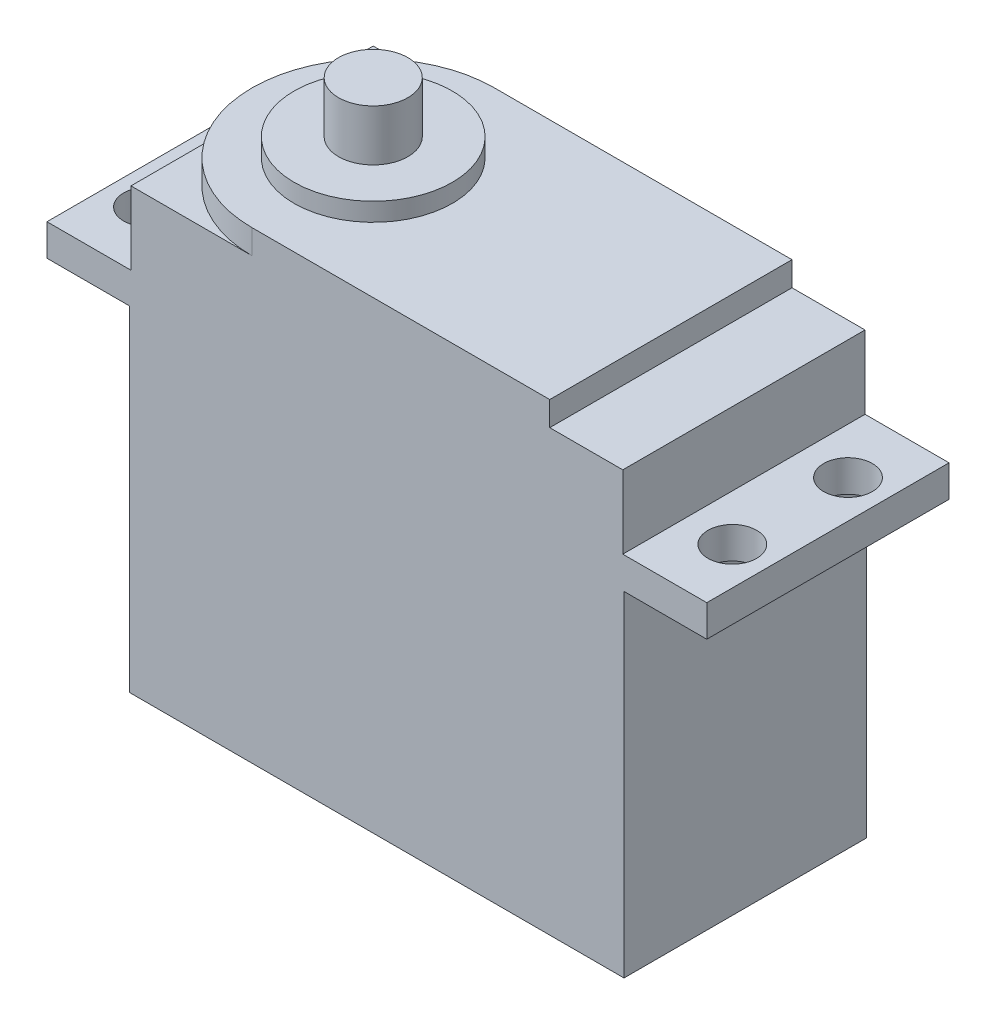
ISO-10303-21;
HEADER;
FILE_DESCRIPTION(('STEP AP214'),'2;1');
FILE_NAME('part.step','',(''),(''),'','','');
FILE_SCHEMA(('AUTOMOTIVE_DESIGN { 1 0 10303 214 1 1 1 1 }'));
ENDSEC;
DATA;
#1=APPLICATION_CONTEXT('core data for automotive mechanical design processes');
#2=APPLICATION_PROTOCOL_DEFINITION('international standard','automotive_design',2000,#1);
#3=PRODUCT_CONTEXT('',#1,'mechanical');
#4=PRODUCT('Part','Part','',(#3));
#5=PRODUCT_RELATED_PRODUCT_CATEGORY('part','',(#4));
#6=PRODUCT_DEFINITION_FORMATION('','',#4);
#7=PRODUCT_DEFINITION_CONTEXT('part definition',#1,'design');
#8=PRODUCT_DEFINITION('design','',#6,#7);
#9=PRODUCT_DEFINITION_SHAPE('','',#8);
#10=(LENGTH_UNIT() NAMED_UNIT(*) SI_UNIT(.MILLI.,.METRE.));
#11=(NAMED_UNIT(*) PLANE_ANGLE_UNIT() SI_UNIT($,.RADIAN.));
#12=(NAMED_UNIT(*) SI_UNIT($,.STERADIAN.) SOLID_ANGLE_UNIT());
#13=UNCERTAINTY_MEASURE_WITH_UNIT(LENGTH_MEASURE(1.E-05),#10,'distance_accuracy_value','');
#14=(GEOMETRIC_REPRESENTATION_CONTEXT(3) GLOBAL_UNCERTAINTY_ASSIGNED_CONTEXT((#13)) GLOBAL_UNIT_ASSIGNED_CONTEXT((#10,
#11,#12)) REPRESENTATION_CONTEXT('',''));
#15=CARTESIAN_POINT('',(0.,0.,0.));
#16=DIRECTION('',(0.,0.,1.));
#17=DIRECTION('',(1.,0.,0.));
#18=AXIS2_PLACEMENT_3D('',#15,#16,#17);
#19=CARTESIAN_POINT('',(0.,36.1,0.));
#20=DIRECTION('',(0.,1.,0.));
#21=DIRECTION('',(0.,0.,1.));
#22=AXIS2_PLACEMENT_3D('',#19,#20,#21);
#23=PLANE('',#22);
#24=DIRECTION('',(-1.,0.,0.));
#25=VECTOR('',#24,1.);
#26=CARTESIAN_POINT('',(-20.2,36.1,-9.95));
#27=LINE('',#26,#25);
#28=CARTESIAN_POINT('',(20.2,36.1,-9.95));
#29=VERTEX_POINT('',#28);
#30=CARTESIAN_POINT('',(14.2,36.1,-9.95));
#31=VERTEX_POINT('',#30);
#32=EDGE_CURVE('E189',#29,#31,#27,.T.);
#33=ORIENTED_EDGE('',*,*,#32,.T.);
#34=DIRECTION('',(0.,0.,1.));
#35=VECTOR('',#34,1.);
#36=CARTESIAN_POINT('',(14.2,36.1,0.));
#37=LINE('',#36,#35);
#38=CARTESIAN_POINT('',(14.2,36.1,9.95));
#39=VERTEX_POINT('',#38);
#40=EDGE_CURVE('E53',#31,#39,#37,.T.);
#41=ORIENTED_EDGE('',*,*,#40,.T.);
#42=DIRECTION('',(1.,0.,0.));
#43=VECTOR('',#42,1.);
#44=CARTESIAN_POINT('',(-20.2,36.1,9.95));
#45=LINE('',#44,#43);
#46=CARTESIAN_POINT('',(20.2,36.1,9.95));
#47=VERTEX_POINT('',#46);
#48=EDGE_CURVE('E195',#39,#47,#45,.T.);
#49=ORIENTED_EDGE('',*,*,#48,.T.);
#50=DIRECTION('',(0.,0.,-1.));
#51=VECTOR('',#50,1.);
#52=CARTESIAN_POINT('',(20.2,36.1,-9.95));
#53=LINE('',#52,#51);
#54=EDGE_CURVE('E186',#47,#29,#53,.T.);
#55=ORIENTED_EDGE('',*,*,#54,.T.);
#56=EDGE_LOOP('',(#33,#41,#49,#55));
#57=FACE_BOUND('',#56,.T.);
#58=ADVANCED_FACE('F36',(#57),#23,.T.);
#59=CARTESIAN_POINT('',(-10.25,36.1,0.));
#60=DIRECTION('',(0.,1.,0.));
#61=DIRECTION('',(0.,0.,1.));
#62=AXIS2_PLACEMENT_3D('',#59,#60,#61);
#63=CIRCLE('',#62,9.95);
#64=CARTESIAN_POINT('',(-10.25,36.1,-9.95));
#65=VERTEX_POINT('',#64);
#66=CARTESIAN_POINT('',(-20.2,36.1,0.));
#67=VERTEX_POINT('',#66);
#68=EDGE_CURVE('E46',#65,#67,#63,.T.);
#69=ORIENTED_EDGE('',*,*,#68,.F.);
#70=CARTESIAN_POINT('',(-20.2,36.1,-9.95));
#71=VERTEX_POINT('',#70);
#72=EDGE_CURVE('E176',#65,#71,#27,.T.);
#73=ORIENTED_EDGE('',*,*,#72,.T.);
#74=DIRECTION('',(0.,0.,1.));
#75=VECTOR('',#74,1.);
#76=CARTESIAN_POINT('',(-20.2,36.1,-9.95));
#77=LINE('',#76,#75);
#78=EDGE_CURVE('E192',#71,#67,#77,.T.);
#79=ORIENTED_EDGE('',*,*,#78,.T.);
#80=EDGE_LOOP('',(#69,#73,#79));
#81=FACE_BOUND('',#80,.T.);
#82=ADVANCED_FACE('F327',(#81),#23,.T.);
#83=CARTESIAN_POINT('',(0.,30.1,0.));
#84=DIRECTION('',(0.,1.,0.));
#85=DIRECTION('',(0.,0.,1.));
#86=AXIS2_PLACEMENT_3D('',#83,#84,#85);
#87=PLANE('',#86);
#88=DIRECTION('',(0.,0.,-1.));
#89=VECTOR('',#88,1.);
#90=CARTESIAN_POINT('',(20.2,30.1,-9.95));
#91=LINE('',#90,#89);
#92=CARTESIAN_POINT('',(20.2,30.1,9.95));
#93=VERTEX_POINT('',#92);
#94=CARTESIAN_POINT('',(20.2,30.1,-9.95));
#95=VERTEX_POINT('',#94);
#96=EDGE_CURVE('E177',#93,#95,#91,.T.);
#97=ORIENTED_EDGE('',*,*,#96,.F.);
#98=DIRECTION('',(1.,0.,0.));
#99=VECTOR('',#98,1.);
#100=CARTESIAN_POINT('',(-27.1,30.1,9.95));
#101=LINE('',#100,#99);
#102=CARTESIAN_POINT('',(27.1,30.1,9.95));
#103=VERTEX_POINT('',#102);
#104=EDGE_CURVE('E246',#93,#103,#101,.T.);
#105=ORIENTED_EDGE('',*,*,#104,.T.);
#106=DIRECTION('',(0.,0.,-1.));
#107=VECTOR('',#106,1.);
#108=CARTESIAN_POINT('',(27.1,30.1,-9.95));
#109=LINE('',#108,#107);
#110=CARTESIAN_POINT('',(27.1,30.1,-9.95));
#111=VERTEX_POINT('',#110);
#112=EDGE_CURVE('E237',#103,#111,#109,.T.);
#113=ORIENTED_EDGE('',*,*,#112,.T.);
#114=DIRECTION('',(-1.,0.,0.));
#115=VECTOR('',#114,1.);
#116=CARTESIAN_POINT('',(-27.1,30.1,-9.95));
#117=LINE('',#116,#115);
#118=EDGE_CURVE('E242',#111,#95,#117,.T.);
#119=ORIENTED_EDGE('',*,*,#118,.T.);
#120=EDGE_LOOP('',(#97,#105,#113,#119));
#121=FACE_BOUND('',#120,.T.);
#122=CARTESIAN_POINT('',(24.,30.1,-4.75));
#123=DIRECTION('',(0.,1.,0.));
#124=DIRECTION('',(0.,0.,-1.));
#125=AXIS2_PLACEMENT_3D('',#122,#123,#124);
#126=CIRCLE('',#125,2.);
#127=CARTESIAN_POINT('',(24.,30.1,-6.75000000000001));
#128=VERTEX_POINT('',#127);
#129=EDGE_CURVE('E213',#128,#128,#126,.T.);
#130=ORIENTED_EDGE('',*,*,#129,.F.);
#131=EDGE_LOOP('',(#130));
#132=FACE_BOUND('',#131,.T.);
#133=CARTESIAN_POINT('',(24.,30.1,4.74999999999999));
#134=DIRECTION('',(0.,1.,0.));
#135=DIRECTION('',(0.,0.,-1.));
#136=AXIS2_PLACEMENT_3D('',#133,#134,#135);
#137=CIRCLE('',#136,2.);
#138=CARTESIAN_POINT('',(24.,30.1,2.74999999999999));
#139=VERTEX_POINT('',#138);
#140=EDGE_CURVE('E219',#139,#139,#137,.T.);
#141=ORIENTED_EDGE('',*,*,#140,.F.);
#142=EDGE_LOOP('',(#141));
#143=FACE_BOUND('',#142,.T.);
#144=ADVANCED_FACE('F350',(#121,#132,#143),#87,.T.);
#145=CARTESIAN_POINT('',(20.3,27.5,-9.95));
#146=DIRECTION('',(-1.,0.,0.));
#147=DIRECTION('',(0.,0.,1.));
#148=AXIS2_PLACEMENT_3D('',#145,#146,#147);
#149=PLANE('',#148);
#150=DIRECTION('',(0.,0.,-1.));
#151=VECTOR('',#150,1.);
#152=CARTESIAN_POINT('',(20.3,0.,-9.95));
#153=LINE('',#152,#151);
#154=CARTESIAN_POINT('',(20.3,0.,9.95));
#155=VERTEX_POINT('',#154);
#156=CARTESIAN_POINT('',(20.3,0.,-9.95));
#157=VERTEX_POINT('',#156);
#158=EDGE_CURVE('E272',#155,#157,#153,.T.);
#159=ORIENTED_EDGE('',*,*,#158,.T.);
#160=DIRECTION('',(0.,-1.,0.));
#161=VECTOR('',#160,1.);
#162=CARTESIAN_POINT('',(20.3,27.5,-9.95));
#163=LINE('',#162,#161);
#164=CARTESIAN_POINT('',(20.3,27.5,-9.95));
#165=VERTEX_POINT('',#164);
#166=EDGE_CURVE('E40',#165,#157,#163,.T.);
#167=ORIENTED_EDGE('',*,*,#166,.F.);
#168=DIRECTION('',(0.,0.,-1.));
#169=VECTOR('',#168,1.);
#170=CARTESIAN_POINT('',(20.3,27.5,-9.95));
#171=LINE('',#170,#169);
#172=CARTESIAN_POINT('',(20.3,27.5,9.95));
#173=VERTEX_POINT('',#172);
#174=EDGE_CURVE('E273',#173,#165,#171,.T.);
#175=ORIENTED_EDGE('',*,*,#174,.F.);
#176=DIRECTION('',(0.,-1.,0.));
#177=VECTOR('',#176,1.);
#178=CARTESIAN_POINT('',(20.3,27.5,9.95));
#179=LINE('',#178,#177);
#180=EDGE_CURVE('E280',#173,#155,#179,.T.);
#181=ORIENTED_EDGE('',*,*,#180,.T.);
#182=EDGE_LOOP('',(#159,#167,#175,#181));
#183=FACE_BOUND('',#182,.T.);
#184=ADVANCED_FACE('F38',(#183),#149,.F.);
#185=CARTESIAN_POINT('',(-20.3,27.5,-9.95));
#186=DIRECTION('',(0.,0.,1.));
#187=DIRECTION('',(1.,0.,0.));
#188=AXIS2_PLACEMENT_3D('',#185,#186,#187);
#189=PLANE('',#188);
#190=DIRECTION('',(-1.,0.,0.));
#191=VECTOR('',#190,1.);
#192=CARTESIAN_POINT('',(-20.3,0.,-9.95));
#193=LINE('',#192,#191);
#194=CARTESIAN_POINT('',(-20.3,0.,-9.95));
#195=VERTEX_POINT('',#194);
#196=EDGE_CURVE('E283',#157,#195,#193,.T.);
#197=ORIENTED_EDGE('',*,*,#196,.T.);
#198=DIRECTION('',(0.,-1.,0.));
#199=VECTOR('',#198,1.);
#200=CARTESIAN_POINT('',(-20.3,27.5,-9.95));
#201=LINE('',#200,#199);
#202=CARTESIAN_POINT('',(-20.3,27.5,-9.95));
#203=VERTEX_POINT('',#202);
#204=EDGE_CURVE('E292',#203,#195,#201,.T.);
#205=ORIENTED_EDGE('',*,*,#204,.F.);
#206=DIRECTION('',(-1.,0.,0.));
#207=VECTOR('',#206,1.);
#208=CARTESIAN_POINT('',(-27.1,27.5,-9.95));
#209=LINE('',#208,#207);
#210=CARTESIAN_POINT('',(-27.1,27.5,-9.95));
#211=VERTEX_POINT('',#210);
#212=EDGE_CURVE('E252',#203,#211,#209,.T.);
#213=ORIENTED_EDGE('',*,*,#212,.T.);
#214=DIRECTION('',(0.,-1.,0.));
#215=VECTOR('',#214,1.);
#216=CARTESIAN_POINT('',(-27.1,30.1,-9.95));
#217=LINE('',#216,#215);
#218=CARTESIAN_POINT('',(-27.1,30.1,-9.95));
#219=VERTEX_POINT('',#218);
#220=EDGE_CURVE('E266',#219,#211,#217,.T.);
#221=ORIENTED_EDGE('',*,*,#220,.F.);
#222=CARTESIAN_POINT('',(-20.2,30.1,-9.95));
#223=VERTEX_POINT('',#222);
#224=EDGE_CURVE('E240',#223,#219,#117,.T.);
#225=ORIENTED_EDGE('',*,*,#224,.F.);
#226=DIRECTION('',(0.,-1.,0.));
#227=VECTOR('',#226,1.);
#228=CARTESIAN_POINT('',(-20.2,36.1,-9.95));
#229=LINE('',#228,#227);
#230=EDGE_CURVE('E206',#71,#223,#229,.T.);
#231=ORIENTED_EDGE('',*,*,#230,.F.);
#232=ORIENTED_EDGE('',*,*,#72,.F.);
#233=DIRECTION('',(0.,-1.,0.));
#234=VECTOR('',#233,1.);
#235=CARTESIAN_POINT('',(-10.25,38.1,-9.95));
#236=LINE('',#235,#234);
#237=CARTESIAN_POINT('',(-10.25,38.1,-9.95));
#238=VERTEX_POINT('',#237);
#239=EDGE_CURVE('E157',#238,#65,#236,.T.);
#240=ORIENTED_EDGE('',*,*,#239,.F.);
#241=DIRECTION('',(-1.,0.,0.));
#242=VECTOR('',#241,1.);
#243=CARTESIAN_POINT('',(0.,38.1,-9.95));
#244=LINE('',#243,#242);
#245=CARTESIAN_POINT('',(14.2,38.1,-9.95));
#246=VERTEX_POINT('',#245);
#247=EDGE_CURVE('E163',#246,#238,#244,.T.);
#248=ORIENTED_EDGE('',*,*,#247,.F.);
#249=DIRECTION('',(0.,-1.,0.));
#250=VECTOR('',#249,1.);
#251=CARTESIAN_POINT('',(14.2,38.1,-9.95));
#252=LINE('',#251,#250);
#253=EDGE_CURVE('E336',#246,#31,#252,.T.);
#254=ORIENTED_EDGE('',*,*,#253,.T.);
#255=ORIENTED_EDGE('',*,*,#32,.F.);
#256=DIRECTION('',(0.,-1.,0.));
#257=VECTOR('',#256,1.);
#258=CARTESIAN_POINT('',(20.2,36.1,-9.95));
#259=LINE('',#258,#257);
#260=EDGE_CURVE('E209',#29,#95,#259,.T.);
#261=ORIENTED_EDGE('',*,*,#260,.T.);
#262=ORIENTED_EDGE('',*,*,#118,.F.);
#263=DIRECTION('',(0.,-1.,0.));
#264=VECTOR('',#263,1.);
#265=CARTESIAN_POINT('',(27.1,30.1,-9.95));
#266=LINE('',#265,#264);
#267=CARTESIAN_POINT('',(27.1,27.5,-9.95));
#268=VERTEX_POINT('',#267);
#269=EDGE_CURVE('E269',#111,#268,#266,.T.);
#270=ORIENTED_EDGE('',*,*,#269,.T.);
#271=EDGE_CURVE('E253',#268,#165,#209,.T.);
#272=ORIENTED_EDGE('',*,*,#271,.T.);
#273=ORIENTED_EDGE('',*,*,#166,.T.);
#274=EDGE_LOOP('',(#197,#205,#213,#221,#225,#231,#232,#240,#248,#254,#255,#261,#262,#270,#272,#273));
#275=FACE_BOUND('',#274,.T.);
#276=ADVANCED_FACE('F174',(#275),#189,.F.);
#277=CARTESIAN_POINT('',(-20.3,27.5,-9.95));
#278=DIRECTION('',(1.,0.,0.));
#279=DIRECTION('',(0.,0.,-1.));
#280=AXIS2_PLACEMENT_3D('',#277,#278,#279);
#281=PLANE('',#280);
#282=DIRECTION('',(0.,0.,1.));
#283=VECTOR('',#282,1.);
#284=CARTESIAN_POINT('',(-20.3,0.,-9.95));
#285=LINE('',#284,#283);
#286=CARTESIAN_POINT('',(-20.3,0.,9.95));
#287=VERTEX_POINT('',#286);
#288=EDGE_CURVE('E285',#195,#287,#285,.T.);
#289=ORIENTED_EDGE('',*,*,#288,.T.);
#290=DIRECTION('',(0.,-1.,0.));
#291=VECTOR('',#290,1.);
#292=CARTESIAN_POINT('',(-20.3,27.5,9.95));
#293=LINE('',#292,#291);
#294=CARTESIAN_POINT('',(-20.3,27.5,9.95));
#295=VERTEX_POINT('',#294);
#296=EDGE_CURVE('E290',#295,#287,#293,.T.);
#297=ORIENTED_EDGE('',*,*,#296,.F.);
#298=DIRECTION('',(0.,0.,1.));
#299=VECTOR('',#298,1.);
#300=CARTESIAN_POINT('',(-20.3,27.5,-9.95));
#301=LINE('',#300,#299);
#302=EDGE_CURVE('E276',#203,#295,#301,.T.);
#303=ORIENTED_EDGE('',*,*,#302,.F.);
#304=ORIENTED_EDGE('',*,*,#204,.T.);
#305=EDGE_LOOP('',(#289,#297,#303,#304));
#306=FACE_BOUND('',#305,.T.);
#307=ADVANCED_FACE('F304',(#306),#281,.F.);
#308=CARTESIAN_POINT('',(-20.3,27.5,9.95));
#309=DIRECTION('',(0.,0.,-1.));
#310=DIRECTION('',(-1.,0.,0.));
#311=AXIS2_PLACEMENT_3D('',#308,#309,#310);
#312=PLANE('',#311);
#313=DIRECTION('',(1.,0.,0.));
#314=VECTOR('',#313,1.);
#315=CARTESIAN_POINT('',(-20.3,0.,9.95));
#316=LINE('',#315,#314);
#317=EDGE_CURVE('E277',#287,#155,#316,.T.);
#318=ORIENTED_EDGE('',*,*,#317,.T.);
#319=ORIENTED_EDGE('',*,*,#180,.F.);
#320=DIRECTION('',(1.,0.,0.));
#321=VECTOR('',#320,1.);
#322=CARTESIAN_POINT('',(-27.1,27.5,9.95));
#323=LINE('',#322,#321);
#324=CARTESIAN_POINT('',(27.1,27.5,9.95));
#325=VERTEX_POINT('',#324);
#326=EDGE_CURVE('E258',#173,#325,#323,.T.);
#327=ORIENTED_EDGE('',*,*,#326,.T.);
#328=DIRECTION('',(0.,-1.,0.));
#329=VECTOR('',#328,1.);
#330=CARTESIAN_POINT('',(27.1,30.1,9.95));
#331=LINE('',#330,#329);
#332=EDGE_CURVE('E249',#103,#325,#331,.T.);
#333=ORIENTED_EDGE('',*,*,#332,.F.);
#334=ORIENTED_EDGE('',*,*,#104,.F.);
#335=DIRECTION('',(0.,-1.,0.));
#336=VECTOR('',#335,1.);
#337=CARTESIAN_POINT('',(20.2,36.1,9.95));
#338=LINE('',#337,#336);
#339=EDGE_CURVE('E197',#47,#93,#338,.T.);
#340=ORIENTED_EDGE('',*,*,#339,.F.);
#341=ORIENTED_EDGE('',*,*,#48,.F.);
#342=DIRECTION('',(0.,-1.,0.));
#343=VECTOR('',#342,1.);
#344=CARTESIAN_POINT('',(14.2,38.1,9.95));
#345=LINE('',#344,#343);
#346=CARTESIAN_POINT('',(14.2,38.1,9.95));
#347=VERTEX_POINT('',#346);
#348=EDGE_CURVE('E182',#347,#39,#345,.T.);
#349=ORIENTED_EDGE('',*,*,#348,.F.);
#350=DIRECTION('',(1.,0.,0.));
#351=VECTOR('',#350,1.);
#352=CARTESIAN_POINT('',(0.,38.1,9.95));
#353=LINE('',#352,#351);
#354=CARTESIAN_POINT('',(-10.25,38.1,9.95));
#355=VERTEX_POINT('',#354);
#356=EDGE_CURVE('E162',#355,#347,#353,.T.);
#357=ORIENTED_EDGE('',*,*,#356,.F.);
#358=DIRECTION('',(0.,-1.,0.));
#359=VECTOR('',#358,1.);
#360=CARTESIAN_POINT('',(-10.25,38.1,9.95));
#361=LINE('',#360,#359);
#362=CARTESIAN_POINT('',(-10.25,36.1,9.95));
#363=VERTEX_POINT('',#362);
#364=EDGE_CURVE('E159',#355,#363,#361,.T.);
#365=ORIENTED_EDGE('',*,*,#364,.T.);
#366=CARTESIAN_POINT('',(-20.2,36.1,9.95));
#367=VERTEX_POINT('',#366);
#368=EDGE_CURVE('E196',#367,#363,#45,.T.);
#369=ORIENTED_EDGE('',*,*,#368,.F.);
#370=DIRECTION('',(0.,-1.,0.));
#371=VECTOR('',#370,1.);
#372=CARTESIAN_POINT('',(-20.2,36.1,9.95));
#373=LINE('',#372,#371);
#374=CARTESIAN_POINT('',(-20.2,30.1,9.95));
#375=VERTEX_POINT('',#374);
#376=EDGE_CURVE('E203',#367,#375,#373,.T.);
#377=ORIENTED_EDGE('',*,*,#376,.T.);
#378=CARTESIAN_POINT('',(-27.1,30.1,9.95));
#379=VERTEX_POINT('',#378);
#380=EDGE_CURVE('E247',#379,#375,#101,.T.);
#381=ORIENTED_EDGE('',*,*,#380,.F.);
#382=DIRECTION('',(0.,-1.,0.));
#383=VECTOR('',#382,1.);
#384=CARTESIAN_POINT('',(-27.1,30.1,9.95));
#385=LINE('',#384,#383);
#386=CARTESIAN_POINT('',(-27.1,27.5,9.95));
#387=VERTEX_POINT('',#386);
#388=EDGE_CURVE('E263',#379,#387,#385,.T.);
#389=ORIENTED_EDGE('',*,*,#388,.T.);
#390=EDGE_CURVE('E241',#387,#295,#323,.T.);
#391=ORIENTED_EDGE('',*,*,#390,.T.);
#392=ORIENTED_EDGE('',*,*,#296,.T.);
#393=EDGE_LOOP('',(#318,#319,#327,#333,#334,#340,#341,#349,#357,#365,#369,#377,#381,#389,#391,#392));
#394=FACE_BOUND('',#393,.T.);
#395=ADVANCED_FACE('F306',(#394),#312,.F.);
#396=CARTESIAN_POINT('',(0.,0.,0.));
#397=DIRECTION('',(0.,1.,0.));
#398=DIRECTION('',(0.,0.,1.));
#399=AXIS2_PLACEMENT_3D('',#396,#397,#398);
#400=PLANE('',#399);
#401=ORIENTED_EDGE('',*,*,#158,.F.);
#402=ORIENTED_EDGE('',*,*,#317,.F.);
#403=ORIENTED_EDGE('',*,*,#288,.F.);
#404=ORIENTED_EDGE('',*,*,#196,.F.);
#405=EDGE_LOOP('',(#401,#402,#403,#404));
#406=FACE_BOUND('',#405,.T.);
#407=ADVANCED_FACE('F303',(#406),#400,.F.);
#408=CARTESIAN_POINT('',(0.,27.5,0.));
#409=DIRECTION('',(0.,1.,0.));
#410=DIRECTION('',(0.,0.,1.));
#411=AXIS2_PLACEMENT_3D('',#408,#409,#410);
#412=PLANE('',#411);
#413=CARTESIAN_POINT('',(24.,27.5,4.74999999999999));
#414=DIRECTION('',(0.,1.,0.));
#415=DIRECTION('',(0.,0.,-1.));
#416=AXIS2_PLACEMENT_3D('',#413,#414,#415);
#417=CIRCLE('',#416,2.);
#418=CARTESIAN_POINT('',(24.,27.5,2.74999999999999));
#419=VERTEX_POINT('',#418);
#420=EDGE_CURVE('E216',#419,#419,#417,.T.);
#421=ORIENTED_EDGE('',*,*,#420,.T.);
#422=EDGE_LOOP('',(#421));
#423=FACE_BOUND('',#422,.T.);
#424=CARTESIAN_POINT('',(24.,27.5,-4.75));
#425=DIRECTION('',(0.,1.,0.));
#426=DIRECTION('',(0.,0.,-1.));
#427=AXIS2_PLACEMENT_3D('',#424,#425,#426);
#428=CIRCLE('',#427,2.);
#429=CARTESIAN_POINT('',(24.,27.5,-6.75000000000001));
#430=VERTEX_POINT('',#429);
#431=EDGE_CURVE('E212',#430,#430,#428,.T.);
#432=ORIENTED_EDGE('',*,*,#431,.T.);
#433=EDGE_LOOP('',(#432));
#434=FACE_BOUND('',#433,.T.);
#435=ORIENTED_EDGE('',*,*,#326,.F.);
#436=ORIENTED_EDGE('',*,*,#174,.T.);
#437=ORIENTED_EDGE('',*,*,#271,.F.);
#438=DIRECTION('',(0.,0.,-1.));
#439=VECTOR('',#438,1.);
#440=CARTESIAN_POINT('',(27.1,27.5,-9.95));
#441=LINE('',#440,#439);
#442=EDGE_CURVE('E234',#325,#268,#441,.T.);
#443=ORIENTED_EDGE('',*,*,#442,.F.);
#444=EDGE_LOOP('',(#435,#436,#437,#443));
#445=FACE_BOUND('',#444,.T.);
#446=ADVANCED_FACE('F358',(#423,#434,#445),#412,.F.);
#447=CARTESIAN_POINT('',(-24.,27.5,4.75));
#448=DIRECTION('',(0.,1.,0.));
#449=DIRECTION('',(0.,0.,1.));
#450=AXIS2_PLACEMENT_3D('',#447,#448,#449);
#451=CIRCLE('',#450,2.);
#452=CARTESIAN_POINT('',(-24.,27.5,6.75));
#453=VERTEX_POINT('',#452);
#454=EDGE_CURVE('E222',#453,#453,#451,.T.);
#455=ORIENTED_EDGE('',*,*,#454,.T.);
#456=EDGE_LOOP('',(#455));
#457=FACE_BOUND('',#456,.T.);
#458=CARTESIAN_POINT('',(-24.,27.5,-4.75));
#459=DIRECTION('',(0.,1.,0.));
#460=DIRECTION('',(0.,0.,1.));
#461=AXIS2_PLACEMENT_3D('',#458,#459,#460);
#462=CIRCLE('',#461,2.);
#463=CARTESIAN_POINT('',(-24.,27.5,-2.75));
#464=VERTEX_POINT('',#463);
#465=EDGE_CURVE('E228',#464,#464,#462,.T.);
#466=ORIENTED_EDGE('',*,*,#465,.T.);
#467=EDGE_LOOP('',(#466));
#468=FACE_BOUND('',#467,.T.);
#469=ORIENTED_EDGE('',*,*,#212,.F.);
#470=ORIENTED_EDGE('',*,*,#302,.T.);
#471=ORIENTED_EDGE('',*,*,#390,.F.);
#472=DIRECTION('',(0.,0.,1.));
#473=VECTOR('',#472,1.);
#474=CARTESIAN_POINT('',(-27.1,27.5,-9.95));
#475=LINE('',#474,#473);
#476=EDGE_CURVE('E256',#211,#387,#475,.T.);
#477=ORIENTED_EDGE('',*,*,#476,.F.);
#478=EDGE_LOOP('',(#469,#470,#471,#477));
#479=FACE_BOUND('',#478,.T.);
#480=ADVANCED_FACE('F313',(#457,#468,#479),#412,.F.);
#481=DIRECTION('',(0.,0.,1.));
#482=VECTOR('',#481,1.);
#483=CARTESIAN_POINT('',(-20.2,30.1,-9.95));
#484=LINE('',#483,#482);
#485=EDGE_CURVE('E180',#223,#375,#484,.T.);
#486=ORIENTED_EDGE('',*,*,#485,.F.);
#487=ORIENTED_EDGE('',*,*,#224,.T.);
#488=DIRECTION('',(0.,0.,1.));
#489=VECTOR('',#488,1.);
#490=CARTESIAN_POINT('',(-27.1,30.1,-9.95));
#491=LINE('',#490,#489);
#492=EDGE_CURVE('E244',#219,#379,#491,.T.);
#493=ORIENTED_EDGE('',*,*,#492,.T.);
#494=ORIENTED_EDGE('',*,*,#380,.T.);
#495=EDGE_LOOP('',(#486,#487,#493,#494));
#496=FACE_BOUND('',#495,.T.);
#497=CARTESIAN_POINT('',(-24.,30.1,-4.75));
#498=DIRECTION('',(0.,1.,0.));
#499=DIRECTION('',(0.,0.,1.));
#500=AXIS2_PLACEMENT_3D('',#497,#498,#499);
#501=CIRCLE('',#500,2.);
#502=CARTESIAN_POINT('',(-24.,30.1,-2.75));
#503=VERTEX_POINT('',#502);
#504=EDGE_CURVE('E231',#503,#503,#501,.T.);
#505=ORIENTED_EDGE('',*,*,#504,.F.);
#506=EDGE_LOOP('',(#505));
#507=FACE_BOUND('',#506,.T.);
#508=CARTESIAN_POINT('',(-24.,30.1,4.75));
#509=DIRECTION('',(0.,1.,0.));
#510=DIRECTION('',(0.,0.,1.));
#511=AXIS2_PLACEMENT_3D('',#508,#509,#510);
#512=CIRCLE('',#511,2.);
#513=CARTESIAN_POINT('',(-24.,30.1,6.75));
#514=VERTEX_POINT('',#513);
#515=EDGE_CURVE('E225',#514,#514,#512,.T.);
#516=ORIENTED_EDGE('',*,*,#515,.F.);
#517=EDGE_LOOP('',(#516));
#518=FACE_BOUND('',#517,.T.);
#519=ADVANCED_FACE('F320',(#496,#507,#518),#87,.T.);
#520=CARTESIAN_POINT('',(27.1,30.1,-9.95));
#521=DIRECTION('',(-1.,0.,0.));
#522=DIRECTION('',(0.,0.,1.));
#523=AXIS2_PLACEMENT_3D('',#520,#521,#522);
#524=PLANE('',#523);
#525=ORIENTED_EDGE('',*,*,#442,.T.);
#526=ORIENTED_EDGE('',*,*,#269,.F.);
#527=ORIENTED_EDGE('',*,*,#112,.F.);
#528=ORIENTED_EDGE('',*,*,#332,.T.);
#529=EDGE_LOOP('',(#525,#526,#527,#528));
#530=FACE_BOUND('',#529,.T.);
#531=ADVANCED_FACE('F354',(#530),#524,.F.);
#532=CARTESIAN_POINT('',(-27.1,30.1,-9.95));
#533=DIRECTION('',(1.,0.,0.));
#534=DIRECTION('',(0.,0.,-1.));
#535=AXIS2_PLACEMENT_3D('',#532,#533,#534);
#536=PLANE('',#535);
#537=ORIENTED_EDGE('',*,*,#476,.T.);
#538=ORIENTED_EDGE('',*,*,#388,.F.);
#539=ORIENTED_EDGE('',*,*,#492,.F.);
#540=ORIENTED_EDGE('',*,*,#220,.T.);
#541=EDGE_LOOP('',(#537,#538,#539,#540));
#542=FACE_BOUND('',#541,.T.);
#543=ADVANCED_FACE('F318',(#542),#536,.F.);
#544=CARTESIAN_POINT('',(-24.,30.1,-4.75));
#545=DIRECTION('',(0.,-1.,0.));
#546=DIRECTION('',(0.,0.,-1.));
#547=AXIS2_PLACEMENT_3D('',#544,#545,#546);
#548=CYLINDRICAL_SURFACE('',#547,2.);
#549=ORIENTED_EDGE('',*,*,#504,.T.);
#550=EDGE_LOOP('',(#549));
#551=FACE_BOUND('',#550,.T.);
#552=ORIENTED_EDGE('',*,*,#465,.F.);
#553=EDGE_LOOP('',(#552));
#554=FACE_BOUND('',#553,.T.);
#555=ADVANCED_FACE('F400',(#551,#554),#548,.F.);
#556=CARTESIAN_POINT('',(-24.,30.1,4.75));
#557=DIRECTION('',(0.,-1.,0.));
#558=DIRECTION('',(0.,0.,-1.));
#559=AXIS2_PLACEMENT_3D('',#556,#557,#558);
#560=CYLINDRICAL_SURFACE('',#559,2.);
#561=ORIENTED_EDGE('',*,*,#515,.T.);
#562=EDGE_LOOP('',(#561));
#563=FACE_BOUND('',#562,.T.);
#564=ORIENTED_EDGE('',*,*,#454,.F.);
#565=EDGE_LOOP('',(#564));
#566=FACE_BOUND('',#565,.T.);
#567=ADVANCED_FACE('F396',(#563,#566),#560,.F.);
#568=CARTESIAN_POINT('',(24.,30.1,4.74999999999999));
#569=DIRECTION('',(0.,-1.,0.));
#570=DIRECTION('',(0.,0.,-1.));
#571=AXIS2_PLACEMENT_3D('',#568,#569,#570);
#572=CYLINDRICAL_SURFACE('',#571,2.);
#573=ORIENTED_EDGE('',*,*,#140,.T.);
#574=EDGE_LOOP('',(#573));
#575=FACE_BOUND('',#574,.T.);
#576=ORIENTED_EDGE('',*,*,#420,.F.);
#577=EDGE_LOOP('',(#576));
#578=FACE_BOUND('',#577,.T.);
#579=ADVANCED_FACE('F392',(#575,#578),#572,.F.);
#580=CARTESIAN_POINT('',(24.,30.1,-4.75));
#581=DIRECTION('',(0.,-1.,0.));
#582=DIRECTION('',(0.,0.,-1.));
#583=AXIS2_PLACEMENT_3D('',#580,#581,#582);
#584=CYLINDRICAL_SURFACE('',#583,2.);
#585=ORIENTED_EDGE('',*,*,#129,.T.);
#586=EDGE_LOOP('',(#585));
#587=FACE_BOUND('',#586,.T.);
#588=ORIENTED_EDGE('',*,*,#431,.F.);
#589=EDGE_LOOP('',(#588));
#590=FACE_BOUND('',#589,.T.);
#591=ADVANCED_FACE('F387',(#587,#590),#584,.F.);
#592=CARTESIAN_POINT('',(20.2,36.1,-9.95));
#593=DIRECTION('',(-1.,0.,0.));
#594=DIRECTION('',(0.,0.,1.));
#595=AXIS2_PLACEMENT_3D('',#592,#593,#594);
#596=PLANE('',#595);
#597=ORIENTED_EDGE('',*,*,#96,.T.);
#598=ORIENTED_EDGE('',*,*,#260,.F.);
#599=ORIENTED_EDGE('',*,*,#54,.F.);
#600=ORIENTED_EDGE('',*,*,#339,.T.);
#601=EDGE_LOOP('',(#597,#598,#599,#600));
#602=FACE_BOUND('',#601,.T.);
#603=ADVANCED_FACE('F346',(#602),#596,.F.);
#604=CARTESIAN_POINT('',(-20.2,36.1,-9.95));
#605=DIRECTION('',(1.,0.,0.));
#606=DIRECTION('',(0.,0.,-1.));
#607=AXIS2_PLACEMENT_3D('',#604,#605,#606);
#608=PLANE('',#607);
#609=ORIENTED_EDGE('',*,*,#485,.T.);
#610=ORIENTED_EDGE('',*,*,#376,.F.);
#611=EDGE_CURVE('E191',#67,#367,#77,.T.);
#612=ORIENTED_EDGE('',*,*,#611,.F.);
#613=ORIENTED_EDGE('',*,*,#78,.F.);
#614=ORIENTED_EDGE('',*,*,#230,.T.);
#615=EDGE_LOOP('',(#609,#610,#612,#613,#614));
#616=FACE_BOUND('',#615,.T.);
#617=ADVANCED_FACE('F324',(#616),#608,.F.);
#618=EDGE_CURVE('E11',#67,#363,#63,.T.);
#619=ORIENTED_EDGE('',*,*,#618,.F.);
#620=ORIENTED_EDGE('',*,*,#611,.T.);
#621=ORIENTED_EDGE('',*,*,#368,.T.);
#622=EDGE_LOOP('',(#619,#620,#621));
#623=FACE_BOUND('',#622,.T.);
#624=ADVANCED_FACE('F373',(#623),#23,.T.);
#625=CARTESIAN_POINT('',(-10.25,38.1,0.));
#626=DIRECTION('',(0.,-1.,0.));
#627=DIRECTION('',(0.,0.,-1.));
#628=AXIS2_PLACEMENT_3D('',#625,#626,#627);
#629=CYLINDRICAL_SURFACE('',#628,9.95);
#630=ORIENTED_EDGE('',*,*,#68,.T.);
#631=ORIENTED_EDGE('',*,*,#618,.T.);
#632=ORIENTED_EDGE('',*,*,#364,.F.);
#633=CARTESIAN_POINT('',(-10.25,38.1,0.));
#634=DIRECTION('',(0.,1.,0.));
#635=DIRECTION('',(0.,0.,1.));
#636=AXIS2_PLACEMENT_3D('',#633,#634,#635);
#637=CIRCLE('',#636,9.95);
#638=EDGE_CURVE('E152',#238,#355,#637,.T.);
#639=ORIENTED_EDGE('',*,*,#638,.F.);
#640=ORIENTED_EDGE('',*,*,#239,.T.);
#641=EDGE_LOOP('',(#630,#631,#632,#639,#640));
#642=FACE_BOUND('',#641,.T.);
#643=ADVANCED_FACE('F155',(#642),#629,.T.);
#644=CARTESIAN_POINT('',(14.2,38.1,0.));
#645=DIRECTION('',(1.,0.,0.));
#646=DIRECTION('',(0.,0.,-1.));
#647=AXIS2_PLACEMENT_3D('',#644,#645,#646);
#648=PLANE('',#647);
#649=ORIENTED_EDGE('',*,*,#40,.F.);
#650=ORIENTED_EDGE('',*,*,#253,.F.);
#651=DIRECTION('',(0.,0.,1.));
#652=VECTOR('',#651,1.);
#653=CARTESIAN_POINT('',(14.2,38.1,0.));
#654=LINE('',#653,#652);
#655=EDGE_CURVE('E169',#246,#347,#654,.T.);
#656=ORIENTED_EDGE('',*,*,#655,.T.);
#657=ORIENTED_EDGE('',*,*,#348,.T.);
#658=EDGE_LOOP('',(#649,#650,#656,#657));
#659=FACE_BOUND('',#658,.T.);
#660=ADVANCED_FACE('F340',(#659),#648,.T.);
#661=CARTESIAN_POINT('',(0.,38.1,0.));
#662=DIRECTION('',(0.,1.,0.));
#663=DIRECTION('',(0.,0.,1.));
#664=AXIS2_PLACEMENT_3D('',#661,#662,#663);
#665=PLANE('',#664);
#666=CARTESIAN_POINT('',(-10.25,38.1,0.));
#667=DIRECTION('',(0.,1.,0.));
#668=DIRECTION('',(0.,0.,1.));
#669=AXIS2_PLACEMENT_3D('',#666,#667,#668);
#670=CIRCLE('',#669,6.5);
#671=CARTESIAN_POINT('',(-10.25,38.1,6.5));
#672=VERTEX_POINT('',#671);
#673=EDGE_CURVE('E331',#672,#672,#670,.T.);
#674=ORIENTED_EDGE('',*,*,#673,.F.);
#675=EDGE_LOOP('',(#674));
#676=FACE_BOUND('',#675,.T.);
#677=ORIENTED_EDGE('',*,*,#247,.T.);
#678=ORIENTED_EDGE('',*,*,#638,.T.);
#679=ORIENTED_EDGE('',*,*,#356,.T.);
#680=ORIENTED_EDGE('',*,*,#655,.F.);
#681=EDGE_LOOP('',(#677,#678,#679,#680));
#682=FACE_BOUND('',#681,.T.);
#683=ADVANCED_FACE('F167',(#676,#682),#665,.T.);
#684=CARTESIAN_POINT('',(-10.25,39.6,0.));
#685=DIRECTION('',(0.,-1.,0.));
#686=DIRECTION('',(0.,0.,-1.));
#687=AXIS2_PLACEMENT_3D('',#684,#685,#686);
#688=CYLINDRICAL_SURFACE('',#687,6.5);
#689=CARTESIAN_POINT('',(-10.25,39.6,0.));
#690=DIRECTION('',(0.,1.,0.));
#691=DIRECTION('',(0.,0.,1.));
#692=AXIS2_PLACEMENT_3D('',#689,#690,#691);
#693=CIRCLE('',#692,6.5);
#694=CARTESIAN_POINT('',(-10.25,39.6,6.5));
#695=VERTEX_POINT('',#694);
#696=EDGE_CURVE('E328',#695,#695,#693,.T.);
#697=ORIENTED_EDGE('',*,*,#696,.F.);
#698=EDGE_LOOP('',(#697));
#699=FACE_BOUND('',#698,.T.);
#700=ORIENTED_EDGE('',*,*,#673,.T.);
#701=EDGE_LOOP('',(#700));
#702=FACE_BOUND('',#701,.T.);
#703=ADVANCED_FACE('F504',(#699,#702),#688,.T.);
#704=CARTESIAN_POINT('',(-10.25,39.6,0.));
#705=DIRECTION('',(0.,1.,0.));
#706=DIRECTION('',(0.,0.,1.));
#707=AXIS2_PLACEMENT_3D('',#704,#705,#706);
#708=PLANE('',#707);
#709=CARTESIAN_POINT('',(-10.25,39.6,0.));
#710=DIRECTION('',(0.,1.,0.));
#711=DIRECTION('',(0.,0.,1.));
#712=AXIS2_PLACEMENT_3D('',#709,#710,#711);
#713=CIRCLE('',#712,2.85);
#714=CARTESIAN_POINT('',(-10.25,39.6,2.85));
#715=VERTEX_POINT('',#714);
#716=EDGE_CURVE('E551',#715,#715,#713,.T.);
#717=ORIENTED_EDGE('',*,*,#716,.F.);
#718=EDGE_LOOP('',(#717));
#719=FACE_BOUND('',#718,.T.);
#720=ORIENTED_EDGE('',*,*,#696,.T.);
#721=EDGE_LOOP('',(#720));
#722=FACE_BOUND('',#721,.T.);
#723=ADVANCED_FACE('F514',(#719,#722),#708,.T.);
#724=CARTESIAN_POINT('',(-10.25,43.8,0.));
#725=DIRECTION('',(0.,-1.,0.));
#726=DIRECTION('',(0.,0.,-1.));
#727=AXIS2_PLACEMENT_3D('',#724,#725,#726);
#728=CYLINDRICAL_SURFACE('',#727,2.85);
#729=CARTESIAN_POINT('',(-10.25,43.8,0.));
#730=DIRECTION('',(0.,1.,0.));
#731=DIRECTION('',(0.,0.,1.));
#732=AXIS2_PLACEMENT_3D('',#729,#730,#731);
#733=CIRCLE('',#732,2.85);
#734=CARTESIAN_POINT('',(-10.25,43.8,2.85));
#735=VERTEX_POINT('',#734);
#736=EDGE_CURVE('E550',#735,#735,#733,.T.);
#737=ORIENTED_EDGE('',*,*,#736,.F.);
#738=EDGE_LOOP('',(#737));
#739=FACE_BOUND('',#738,.T.);
#740=ORIENTED_EDGE('',*,*,#716,.T.);
#741=EDGE_LOOP('',(#740));
#742=FACE_BOUND('',#741,.T.);
#743=ADVANCED_FACE('F524',(#739,#742),#728,.T.);
#744=CARTESIAN_POINT('',(-10.25,43.8,0.));
#745=DIRECTION('',(0.,1.,0.));
#746=DIRECTION('',(0.,0.,1.));
#747=AXIS2_PLACEMENT_3D('',#744,#745,#746);
#748=PLANE('',#747);
#749=ORIENTED_EDGE('',*,*,#736,.T.);
#750=EDGE_LOOP('',(#749));
#751=FACE_BOUND('',#750,.T.);
#752=ADVANCED_FACE('F534',(#751),#748,.T.);
#753=CLOSED_SHELL('',(#58,#82,#144,#184,#276,#307,#395,#407,#446,#480,#519,#531,#543,#555,#567,
#579,#591,#603,#617,#624,#643,#660,#683,#703,#723,#743,#752));
#754=MANIFOLD_SOLID_BREP('B2',#753);
#755=ADVANCED_BREP_SHAPE_REPRESENTATION('',(#18,#754),#14);
#756=SHAPE_DEFINITION_REPRESENTATION(#9,#755);
ENDSEC;
END-ISO-10303-21;
